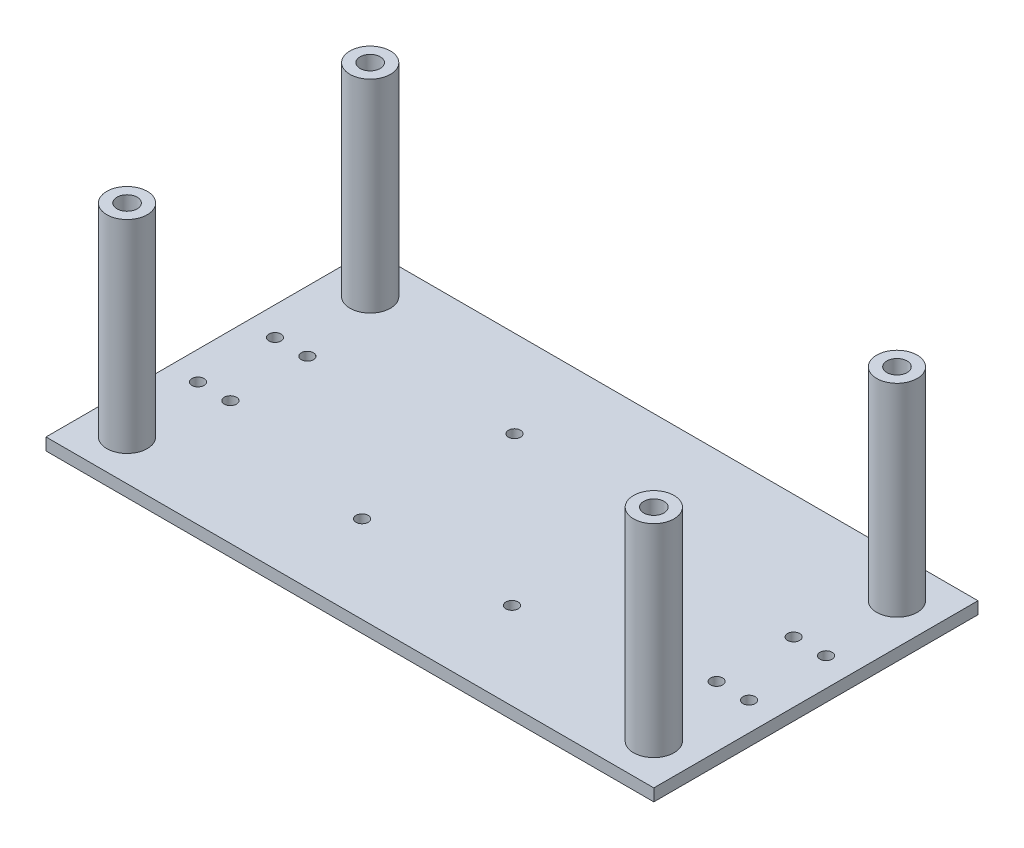
ISO-10303-21;
HEADER;
FILE_DESCRIPTION(('STEP AP214'),'2;1');
FILE_NAME('part.step','',(''),(''),'','','');
FILE_SCHEMA(('AUTOMOTIVE_DESIGN { 1 0 10303 214 1 1 1 1 }'));
ENDSEC;
DATA;
#1=APPLICATION_CONTEXT('core data for automotive mechanical design processes');
#2=APPLICATION_PROTOCOL_DEFINITION('international standard','automotive_design',2000,#1);
#3=PRODUCT_CONTEXT('',#1,'mechanical');
#4=PRODUCT('Part','Part','',(#3));
#5=PRODUCT_RELATED_PRODUCT_CATEGORY('part','',(#4));
#6=PRODUCT_DEFINITION_FORMATION('','',#4);
#7=PRODUCT_DEFINITION_CONTEXT('part definition',#1,'design');
#8=PRODUCT_DEFINITION('design','',#6,#7);
#9=PRODUCT_DEFINITION_SHAPE('','',#8);
#10=(LENGTH_UNIT() NAMED_UNIT(*) SI_UNIT(.MILLI.,.METRE.));
#11=(NAMED_UNIT(*) PLANE_ANGLE_UNIT() SI_UNIT($,.RADIAN.));
#12=(NAMED_UNIT(*) SI_UNIT($,.STERADIAN.) SOLID_ANGLE_UNIT());
#13=UNCERTAINTY_MEASURE_WITH_UNIT(LENGTH_MEASURE(1.E-05),#10,'distance_accuracy_value','');
#14=(GEOMETRIC_REPRESENTATION_CONTEXT(3) GLOBAL_UNCERTAINTY_ASSIGNED_CONTEXT((#13)) GLOBAL_UNIT_ASSIGNED_CONTEXT((#10,
#11,#12)) REPRESENTATION_CONTEXT('',''));
#15=CARTESIAN_POINT('',(0.,0.,0.));
#16=DIRECTION('',(0.,0.,1.));
#17=DIRECTION('',(1.,0.,0.));
#18=AXIS2_PLACEMENT_3D('',#15,#16,#17);
#19=CARTESIAN_POINT('',(66.5352697095436,-3.,0.));
#20=DIRECTION('',(-1.,0.,0.));
#21=DIRECTION('',(0.,0.,1.));
#22=AXIS2_PLACEMENT_3D('',#19,#20,#21);
#23=PLANE('',#22);
#24=DIRECTION('',(0.,0.,1.));
#25=VECTOR('',#24,1.);
#26=CARTESIAN_POINT('',(66.5352697095436,0.,0.));
#27=LINE('',#26,#25);
#28=CARTESIAN_POINT('',(66.5352697095435,0.,-41.8257261410789));
#29=VERTEX_POINT('',#28);
#30=CARTESIAN_POINT('',(66.5352697095436,0.,38.1742738589212));
#31=VERTEX_POINT('',#30);
#32=EDGE_CURVE('E149',#29,#31,#27,.T.);
#33=ORIENTED_EDGE('',*,*,#32,.T.);
#34=DIRECTION('',(0.,1.,0.));
#35=VECTOR('',#34,1.);
#36=CARTESIAN_POINT('',(66.5352697095436,-3.,38.1742738589212));
#37=LINE('',#36,#35);
#38=CARTESIAN_POINT('',(66.5352697095436,-3.,38.1742738589212));
#39=VERTEX_POINT('',#38);
#40=EDGE_CURVE('E86',#39,#31,#37,.T.);
#41=ORIENTED_EDGE('',*,*,#40,.F.);
#42=DIRECTION('',(0.,0.,1.));
#43=VECTOR('',#42,1.);
#44=CARTESIAN_POINT('',(66.5352697095436,-3.,0.));
#45=LINE('',#44,#43);
#46=CARTESIAN_POINT('',(66.5352697095435,-3.,-41.8257261410789));
#47=VERTEX_POINT('',#46);
#48=EDGE_CURVE('E62',#47,#39,#45,.T.);
#49=ORIENTED_EDGE('',*,*,#48,.F.);
#50=DIRECTION('',(0.,1.,0.));
#51=VECTOR('',#50,1.);
#52=CARTESIAN_POINT('',(66.5352697095435,-3.,-41.8257261410789));
#53=LINE('',#52,#51);
#54=EDGE_CURVE('E101',#47,#29,#53,.T.);
#55=ORIENTED_EDGE('',*,*,#54,.T.);
#56=EDGE_LOOP('',(#33,#41,#49,#55));
#57=FACE_BOUND('',#56,.T.);
#58=ADVANCED_FACE('F42',(#57),#23,.F.);
#59=CARTESIAN_POINT('',(0.,-3.,38.1742738589212));
#60=DIRECTION('',(0.,0.,1.));
#61=DIRECTION('',(1.,0.,0.));
#62=AXIS2_PLACEMENT_3D('',#59,#60,#61);
#63=PLANE('',#62);
#64=DIRECTION('',(1.,0.,0.));
#65=VECTOR('',#64,1.);
#66=CARTESIAN_POINT('',(0.,0.,38.1742738589212));
#67=LINE('',#66,#65);
#68=CARTESIAN_POINT('',(-83.4647302904564,0.,38.1742738589212));
#69=VERTEX_POINT('',#68);
#70=EDGE_CURVE('E157',#69,#31,#67,.T.);
#71=ORIENTED_EDGE('',*,*,#70,.F.);
#72=DIRECTION('',(0.,1.,0.));
#73=VECTOR('',#72,1.);
#74=CARTESIAN_POINT('',(-83.4647302904564,-3.,38.1742738589212));
#75=LINE('',#74,#73);
#76=CARTESIAN_POINT('',(-83.4647302904564,-3.,38.1742738589212));
#77=VERTEX_POINT('',#76);
#78=EDGE_CURVE('E79',#77,#69,#75,.T.);
#79=ORIENTED_EDGE('',*,*,#78,.F.);
#80=DIRECTION('',(1.,0.,0.));
#81=VECTOR('',#80,1.);
#82=CARTESIAN_POINT('',(0.,-3.,38.1742738589212));
#83=LINE('',#82,#81);
#84=EDGE_CURVE('E109',#77,#39,#83,.T.);
#85=ORIENTED_EDGE('',*,*,#84,.T.);
#86=ORIENTED_EDGE('',*,*,#40,.T.);
#87=EDGE_LOOP('',(#71,#79,#85,#86));
#88=FACE_BOUND('',#87,.T.);
#89=ADVANCED_FACE('F323',(#88),#63,.T.);
#90=CARTESIAN_POINT('',(-83.4647302904564,-3.,0.));
#91=DIRECTION('',(-1.,0.,0.));
#92=DIRECTION('',(0.,0.,1.));
#93=AXIS2_PLACEMENT_3D('',#90,#91,#92);
#94=PLANE('',#93);
#95=DIRECTION('',(0.,0.,1.));
#96=VECTOR('',#95,1.);
#97=CARTESIAN_POINT('',(-83.4647302904564,0.,0.));
#98=LINE('',#97,#96);
#99=CARTESIAN_POINT('',(-83.4647302904565,0.,-41.8257261410789));
#100=VERTEX_POINT('',#99);
#101=EDGE_CURVE('E97',#100,#69,#98,.T.);
#102=ORIENTED_EDGE('',*,*,#101,.F.);
#103=DIRECTION('',(0.,1.,0.));
#104=VECTOR('',#103,1.);
#105=CARTESIAN_POINT('',(-83.4647302904565,-3.,-41.8257261410789));
#106=LINE('',#105,#104);
#107=CARTESIAN_POINT('',(-83.4647302904565,-3.,-41.8257261410789));
#108=VERTEX_POINT('',#107);
#109=EDGE_CURVE('E94',#108,#100,#106,.T.);
#110=ORIENTED_EDGE('',*,*,#109,.F.);
#111=DIRECTION('',(0.,0.,1.));
#112=VECTOR('',#111,1.);
#113=CARTESIAN_POINT('',(-83.4647302904564,-3.,0.));
#114=LINE('',#113,#112);
#115=EDGE_CURVE('E96',#108,#77,#114,.T.);
#116=ORIENTED_EDGE('',*,*,#115,.T.);
#117=ORIENTED_EDGE('',*,*,#78,.T.);
#118=EDGE_LOOP('',(#102,#110,#116,#117));
#119=FACE_BOUND('',#118,.T.);
#120=ADVANCED_FACE('F95',(#119),#94,.T.);
#121=CARTESIAN_POINT('',(-68.4647302904565,-3.,-11.3257261410788));
#122=DIRECTION('',(0.,1.,0.));
#123=DIRECTION('',(0.,0.,1.));
#124=AXIS2_PLACEMENT_3D('',#121,#122,#123);
#125=CYLINDRICAL_SURFACE('',#124,1.5);
#126=CARTESIAN_POINT('',(-68.4647302904565,-3.,-11.3257261410788));
#127=DIRECTION('',(0.,1.,0.));
#128=DIRECTION('',(0.,0.,1.));
#129=AXIS2_PLACEMENT_3D('',#126,#127,#128);
#130=CIRCLE('',#129,1.5);
#131=CARTESIAN_POINT('',(-68.4647302904565,-3.,-9.82572614107885));
#132=VERTEX_POINT('',#131);
#133=EDGE_CURVE('E128',#132,#132,#130,.T.);
#134=ORIENTED_EDGE('',*,*,#133,.F.);
#135=EDGE_LOOP('',(#134));
#136=FACE_BOUND('',#135,.T.);
#137=CARTESIAN_POINT('',(-68.4647302904565,0.,-11.3257261410788));
#138=DIRECTION('',(0.,1.,0.));
#139=DIRECTION('',(0.,0.,1.));
#140=AXIS2_PLACEMENT_3D('',#137,#138,#139);
#141=CIRCLE('',#140,1.5);
#142=CARTESIAN_POINT('',(-68.4647302904565,0.,-9.82572614107885));
#143=VERTEX_POINT('',#142);
#144=EDGE_CURVE('E173',#143,#143,#141,.T.);
#145=ORIENTED_EDGE('',*,*,#144,.T.);
#146=EDGE_LOOP('',(#145));
#147=FACE_BOUND('',#146,.T.);
#148=ADVANCED_FACE('F675',(#136,#147),#125,.F.);
#149=CARTESIAN_POINT('',(-76.4647302904565,-3.,-11.3257261410788));
#150=DIRECTION('',(0.,1.,0.));
#151=DIRECTION('',(0.,0.,1.));
#152=AXIS2_PLACEMENT_3D('',#149,#150,#151);
#153=CYLINDRICAL_SURFACE('',#152,1.5);
#154=CARTESIAN_POINT('',(-76.4647302904565,-3.,-11.3257261410788));
#155=DIRECTION('',(0.,1.,0.));
#156=DIRECTION('',(0.,0.,1.));
#157=AXIS2_PLACEMENT_3D('',#154,#155,#156);
#158=CIRCLE('',#157,1.5);
#159=CARTESIAN_POINT('',(-76.4647302904565,-3.,-9.82572614107885));
#160=VERTEX_POINT('',#159);
#161=EDGE_CURVE('E124',#160,#160,#158,.T.);
#162=ORIENTED_EDGE('',*,*,#161,.F.);
#163=EDGE_LOOP('',(#162));
#164=FACE_BOUND('',#163,.T.);
#165=CARTESIAN_POINT('',(-76.4647302904565,0.,-11.3257261410788));
#166=DIRECTION('',(0.,1.,0.));
#167=DIRECTION('',(0.,0.,1.));
#168=AXIS2_PLACEMENT_3D('',#165,#166,#167);
#169=CIRCLE('',#168,1.5);
#170=CARTESIAN_POINT('',(-76.4647302904565,0.,-9.82572614107885));
#171=VERTEX_POINT('',#170);
#172=EDGE_CURVE('E169',#171,#171,#169,.T.);
#173=ORIENTED_EDGE('',*,*,#172,.T.);
#174=EDGE_LOOP('',(#173));
#175=FACE_BOUND('',#174,.T.);
#176=ADVANCED_FACE('F666',(#164,#175),#153,.F.);
#177=CARTESIAN_POINT('',(59.5352697095435,-3.,-11.3257261410789));
#178=DIRECTION('',(0.,1.,0.));
#179=DIRECTION('',(0.,0.,1.));
#180=AXIS2_PLACEMENT_3D('',#177,#178,#179);
#181=CYLINDRICAL_SURFACE('',#180,1.5);
#182=CARTESIAN_POINT('',(59.5352697095435,-3.,-11.3257261410789));
#183=DIRECTION('',(0.,1.,0.));
#184=DIRECTION('',(0.,0.,1.));
#185=AXIS2_PLACEMENT_3D('',#182,#183,#184);
#186=CIRCLE('',#185,1.5);
#187=CARTESIAN_POINT('',(59.5352697095435,-3.,-9.82572614107888));
#188=VERTEX_POINT('',#187);
#189=EDGE_CURVE('E120',#188,#188,#186,.F.);
#190=ORIENTED_EDGE('',*,*,#189,.T.);
#191=EDGE_LOOP('',(#190));
#192=FACE_BOUND('',#191,.T.);
#193=CARTESIAN_POINT('',(59.5352697095435,0.,-11.3257261410789));
#194=DIRECTION('',(0.,1.,0.));
#195=DIRECTION('',(0.,0.,1.));
#196=AXIS2_PLACEMENT_3D('',#193,#194,#195);
#197=CIRCLE('',#196,1.5);
#198=CARTESIAN_POINT('',(59.5352697095435,0.,-9.82572614107888));
#199=VERTEX_POINT('',#198);
#200=EDGE_CURVE('E165',#199,#199,#197,.F.);
#201=ORIENTED_EDGE('',*,*,#200,.F.);
#202=EDGE_LOOP('',(#201));
#203=FACE_BOUND('',#202,.T.);
#204=ADVANCED_FACE('F657',(#192,#203),#181,.F.);
#205=CARTESIAN_POINT('',(59.5352697095436,-3.,7.67427385892113));
#206=DIRECTION('',(0.,1.,0.));
#207=DIRECTION('',(0.,0.,1.));
#208=AXIS2_PLACEMENT_3D('',#205,#206,#207);
#209=CYLINDRICAL_SURFACE('',#208,1.5);
#210=CARTESIAN_POINT('',(59.5352697095436,-3.,7.67427385892113));
#211=DIRECTION('',(0.,1.,0.));
#212=DIRECTION('',(0.,0.,1.));
#213=AXIS2_PLACEMENT_3D('',#210,#211,#212);
#214=CIRCLE('',#213,1.5);
#215=CARTESIAN_POINT('',(59.5352697095436,-3.,9.17427385892113));
#216=VERTEX_POINT('',#215);
#217=EDGE_CURVE('E113',#216,#216,#214,.F.);
#218=ORIENTED_EDGE('',*,*,#217,.T.);
#219=EDGE_LOOP('',(#218));
#220=FACE_BOUND('',#219,.T.);
#221=CARTESIAN_POINT('',(59.5352697095436,0.,7.67427385892113));
#222=DIRECTION('',(0.,1.,0.));
#223=DIRECTION('',(0.,0.,1.));
#224=AXIS2_PLACEMENT_3D('',#221,#222,#223);
#225=CIRCLE('',#224,1.5);
#226=CARTESIAN_POINT('',(59.5352697095436,0.,9.17427385892113));
#227=VERTEX_POINT('',#226);
#228=EDGE_CURVE('E161',#227,#227,#225,.F.);
#229=ORIENTED_EDGE('',*,*,#228,.F.);
#230=EDGE_LOOP('',(#229));
#231=FACE_BOUND('',#230,.T.);
#232=ADVANCED_FACE('F650',(#220,#231),#209,.F.);
#233=CARTESIAN_POINT('',(0.,-3.,-41.8257261410789));
#234=DIRECTION('',(0.,0.,1.));
#235=DIRECTION('',(1.,0.,0.));
#236=AXIS2_PLACEMENT_3D('',#233,#234,#235);
#237=PLANE('',#236);
#238=DIRECTION('',(1.,0.,0.));
#239=VECTOR('',#238,1.);
#240=CARTESIAN_POINT('',(0.,0.,-41.8257261410789));
#241=LINE('',#240,#239);
#242=EDGE_CURVE('E152',#100,#29,#241,.T.);
#243=ORIENTED_EDGE('',*,*,#242,.T.);
#244=ORIENTED_EDGE('',*,*,#54,.F.);
#245=DIRECTION('',(1.,0.,0.));
#246=VECTOR('',#245,1.);
#247=CARTESIAN_POINT('',(0.,-3.,-41.8257261410789));
#248=LINE('',#247,#246);
#249=EDGE_CURVE('E91',#108,#47,#248,.T.);
#250=ORIENTED_EDGE('',*,*,#249,.F.);
#251=ORIENTED_EDGE('',*,*,#109,.T.);
#252=EDGE_LOOP('',(#243,#244,#250,#251));
#253=FACE_BOUND('',#252,.T.);
#254=ADVANCED_FACE('F103',(#253),#237,.F.);
#255=CARTESIAN_POINT('',(-68.4647302904565,-3.,7.67427385892115));
#256=DIRECTION('',(0.,1.,0.));
#257=DIRECTION('',(0.,0.,1.));
#258=AXIS2_PLACEMENT_3D('',#255,#256,#257);
#259=CYLINDRICAL_SURFACE('',#258,1.5);
#260=CARTESIAN_POINT('',(-68.4647302904565,-3.,7.67427385892115));
#261=DIRECTION('',(0.,1.,0.));
#262=DIRECTION('',(0.,0.,1.));
#263=AXIS2_PLACEMENT_3D('',#260,#261,#262);
#264=CIRCLE('',#263,1.5);
#265=CARTESIAN_POINT('',(-68.4647302904565,-3.,9.17427385892115));
#266=VERTEX_POINT('',#265);
#267=EDGE_CURVE('E275',#266,#266,#264,.T.);
#268=ORIENTED_EDGE('',*,*,#267,.F.);
#269=EDGE_LOOP('',(#268));
#270=FACE_BOUND('',#269,.T.);
#271=CARTESIAN_POINT('',(-68.4647302904565,0.,7.67427385892115));
#272=DIRECTION('',(0.,1.,0.));
#273=DIRECTION('',(0.,0.,1.));
#274=AXIS2_PLACEMENT_3D('',#271,#272,#273);
#275=CIRCLE('',#274,1.5);
#276=CARTESIAN_POINT('',(-68.4647302904565,0.,9.17427385892115));
#277=VERTEX_POINT('',#276);
#278=EDGE_CURVE('E145',#277,#277,#275,.T.);
#279=ORIENTED_EDGE('',*,*,#278,.T.);
#280=EDGE_LOOP('',(#279));
#281=FACE_BOUND('',#280,.T.);
#282=ADVANCED_FACE('F282',(#270,#281),#259,.F.);
#283=CARTESIAN_POINT('',(-76.4647302904564,-3.,7.67427385892115));
#284=DIRECTION('',(0.,1.,0.));
#285=DIRECTION('',(0.,0.,1.));
#286=AXIS2_PLACEMENT_3D('',#283,#284,#285);
#287=CYLINDRICAL_SURFACE('',#286,1.5);
#288=CARTESIAN_POINT('',(-76.4647302904564,-3.,7.67427385892115));
#289=DIRECTION('',(0.,1.,0.));
#290=DIRECTION('',(0.,0.,1.));
#291=AXIS2_PLACEMENT_3D('',#288,#289,#290);
#292=CIRCLE('',#291,1.5);
#293=CARTESIAN_POINT('',(-76.4647302904564,-3.,9.17427385892115));
#294=VERTEX_POINT('',#293);
#295=EDGE_CURVE('E271',#294,#294,#292,.T.);
#296=ORIENTED_EDGE('',*,*,#295,.F.);
#297=EDGE_LOOP('',(#296));
#298=FACE_BOUND('',#297,.T.);
#299=CARTESIAN_POINT('',(-76.4647302904564,0.,7.67427385892115));
#300=DIRECTION('',(0.,1.,0.));
#301=DIRECTION('',(0.,0.,1.));
#302=AXIS2_PLACEMENT_3D('',#299,#300,#301);
#303=CIRCLE('',#302,1.5);
#304=CARTESIAN_POINT('',(-76.4647302904564,0.,9.17427385892115));
#305=VERTEX_POINT('',#304);
#306=EDGE_CURVE('E140',#305,#305,#303,.T.);
#307=ORIENTED_EDGE('',*,*,#306,.T.);
#308=EDGE_LOOP('',(#307));
#309=FACE_BOUND('',#308,.T.);
#310=ADVANCED_FACE('F285',(#298,#309),#287,.F.);
#311=CARTESIAN_POINT('',(51.5352697095436,-3.,7.67427385892113));
#312=DIRECTION('',(0.,1.,0.));
#313=DIRECTION('',(0.,0.,1.));
#314=AXIS2_PLACEMENT_3D('',#311,#312,#313);
#315=CYLINDRICAL_SURFACE('',#314,1.5);
#316=CARTESIAN_POINT('',(51.5352697095436,-3.,7.67427385892113));
#317=DIRECTION('',(0.,1.,0.));
#318=DIRECTION('',(0.,0.,1.));
#319=AXIS2_PLACEMENT_3D('',#316,#317,#318);
#320=CIRCLE('',#319,1.5);
#321=CARTESIAN_POINT('',(51.5352697095436,-3.,9.17427385892113));
#322=VERTEX_POINT('',#321);
#323=EDGE_CURVE('E181',#322,#322,#320,.F.);
#324=ORIENTED_EDGE('',*,*,#323,.T.);
#325=EDGE_LOOP('',(#324));
#326=FACE_BOUND('',#325,.T.);
#327=CARTESIAN_POINT('',(51.5352697095436,0.,7.67427385892113));
#328=DIRECTION('',(0.,1.,0.));
#329=DIRECTION('',(0.,0.,1.));
#330=AXIS2_PLACEMENT_3D('',#327,#328,#329);
#331=CIRCLE('',#330,1.5);
#332=CARTESIAN_POINT('',(51.5352697095436,0.,9.17427385892113));
#333=VERTEX_POINT('',#332);
#334=EDGE_CURVE('E136',#333,#333,#331,.F.);
#335=ORIENTED_EDGE('',*,*,#334,.F.);
#336=EDGE_LOOP('',(#335));
#337=FACE_BOUND('',#336,.T.);
#338=ADVANCED_FACE('F44',(#326,#337),#315,.F.);
#339=CARTESIAN_POINT('',(51.5352697095436,-3.,-11.3257261410789));
#340=DIRECTION('',(0.,1.,0.));
#341=DIRECTION('',(0.,0.,1.));
#342=AXIS2_PLACEMENT_3D('',#339,#340,#341);
#343=CYLINDRICAL_SURFACE('',#342,1.49999999999999);
#344=CARTESIAN_POINT('',(51.5352697095436,-3.,-11.3257261410789));
#345=DIRECTION('',(0.,1.,0.));
#346=DIRECTION('',(0.,0.,1.));
#347=AXIS2_PLACEMENT_3D('',#344,#345,#346);
#348=CIRCLE('',#347,1.49999999999999);
#349=CARTESIAN_POINT('',(51.5352697095436,-3.,-9.82572614107888));
#350=VERTEX_POINT('',#349);
#351=EDGE_CURVE('E132',#350,#350,#348,.F.);
#352=ORIENTED_EDGE('',*,*,#351,.T.);
#353=EDGE_LOOP('',(#352));
#354=FACE_BOUND('',#353,.T.);
#355=CARTESIAN_POINT('',(51.5352697095436,0.,-11.3257261410789));
#356=DIRECTION('',(0.,1.,0.));
#357=DIRECTION('',(0.,0.,1.));
#358=AXIS2_PLACEMENT_3D('',#355,#356,#357);
#359=CIRCLE('',#358,1.49999999999999);
#360=CARTESIAN_POINT('',(51.5352697095436,0.,-9.82572614107888));
#361=VERTEX_POINT('',#360);
#362=EDGE_CURVE('E177',#361,#361,#359,.F.);
#363=ORIENTED_EDGE('',*,*,#362,.F.);
#364=EDGE_LOOP('',(#363));
#365=FACE_BOUND('',#364,.T.);
#366=ADVANCED_FACE('F309',(#354,#365),#343,.F.);
#367=CARTESIAN_POINT('',(0.,-3.,0.));
#368=DIRECTION('',(0.,1.,0.));
#369=DIRECTION('',(0.,0.,1.));
#370=AXIS2_PLACEMENT_3D('',#367,#368,#369);
#371=PLANE('',#370);
#372=CARTESIAN_POINT('',(-26.353154242644,-3.,-20.3257261410788));
#373=DIRECTION('',(0.,-1.,0.));
#374=DIRECTION('',(0.,0.,-1.));
#375=AXIS2_PLACEMENT_3D('',#372,#373,#374);
#376=CIRCLE('',#375,1.5);
#377=CARTESIAN_POINT('',(-26.353154242644,-3.,-21.8257261410788));
#378=VERTEX_POINT('',#377);
#379=EDGE_CURVE('E561',#378,#378,#376,.T.);
#380=ORIENTED_EDGE('',*,*,#379,.F.);
#381=EDGE_LOOP('',(#380));
#382=FACE_BOUND('',#381,.T.);
#383=CARTESIAN_POINT('',(10.0352697095436,-3.,-20.3257261410788));
#384=DIRECTION('',(0.,-1.,0.));
#385=DIRECTION('',(0.,0.,-1.));
#386=AXIS2_PLACEMENT_3D('',#383,#384,#385);
#387=CIRCLE('',#386,1.5);
#388=CARTESIAN_POINT('',(10.0352697095436,-3.,-21.8257261410788));
#389=VERTEX_POINT('',#388);
#390=EDGE_CURVE('E563',#389,#389,#387,.T.);
#391=ORIENTED_EDGE('',*,*,#390,.F.);
#392=EDGE_LOOP('',(#391));
#393=FACE_BOUND('',#392,.T.);
#394=CARTESIAN_POINT('',(10.0352697095435,-3.,16.6742738589212));
#395=DIRECTION('',(0.,-1.,0.));
#396=DIRECTION('',(0.,0.,-1.));
#397=AXIS2_PLACEMENT_3D('',#394,#395,#396);
#398=CIRCLE('',#397,1.5);
#399=CARTESIAN_POINT('',(10.0352697095435,-3.,15.1742738589212));
#400=VERTEX_POINT('',#399);
#401=EDGE_CURVE('E566',#400,#400,#398,.T.);
#402=ORIENTED_EDGE('',*,*,#401,.F.);
#403=EDGE_LOOP('',(#402));
#404=FACE_BOUND('',#403,.T.);
#405=CARTESIAN_POINT('',(-26.9647302904565,-3.,16.6742738589212));
#406=DIRECTION('',(0.,-1.,0.));
#407=DIRECTION('',(0.,0.,-1.));
#408=AXIS2_PLACEMENT_3D('',#405,#406,#407);
#409=CIRCLE('',#408,1.5);
#410=CARTESIAN_POINT('',(-26.9647302904565,-3.,15.1742738589212));
#411=VERTEX_POINT('',#410);
#412=EDGE_CURVE('E204',#411,#411,#409,.T.);
#413=ORIENTED_EDGE('',*,*,#412,.F.);
#414=EDGE_LOOP('',(#413));
#415=FACE_BOUND('',#414,.T.);
#416=ORIENTED_EDGE('',*,*,#323,.F.);
#417=EDGE_LOOP('',(#416));
#418=FACE_BOUND('',#417,.T.);
#419=ORIENTED_EDGE('',*,*,#295,.T.);
#420=EDGE_LOOP('',(#419));
#421=FACE_BOUND('',#420,.T.);
#422=ORIENTED_EDGE('',*,*,#267,.T.);
#423=EDGE_LOOP('',(#422));
#424=FACE_BOUND('',#423,.T.);
#425=ORIENTED_EDGE('',*,*,#48,.T.);
#426=ORIENTED_EDGE('',*,*,#84,.F.);
#427=ORIENTED_EDGE('',*,*,#115,.F.);
#428=ORIENTED_EDGE('',*,*,#249,.T.);
#429=EDGE_LOOP('',(#425,#426,#427,#428));
#430=FACE_BOUND('',#429,.T.);
#431=ORIENTED_EDGE('',*,*,#217,.F.);
#432=EDGE_LOOP('',(#431));
#433=FACE_BOUND('',#432,.T.);
#434=ORIENTED_EDGE('',*,*,#189,.F.);
#435=EDGE_LOOP('',(#434));
#436=FACE_BOUND('',#435,.T.);
#437=ORIENTED_EDGE('',*,*,#161,.T.);
#438=EDGE_LOOP('',(#437));
#439=FACE_BOUND('',#438,.T.);
#440=ORIENTED_EDGE('',*,*,#133,.T.);
#441=EDGE_LOOP('',(#440));
#442=FACE_BOUND('',#441,.T.);
#443=ORIENTED_EDGE('',*,*,#351,.F.);
#444=EDGE_LOOP('',(#443));
#445=FACE_BOUND('',#444,.T.);
#446=ADVANCED_FACE('F107',(#382,#393,#404,#415,#418,#421,#424,#430,#433,#436,#439,#442,#445),
#371,.F.);
#447=CARTESIAN_POINT('',(0.,0.,0.));
#448=DIRECTION('',(0.,1.,0.));
#449=DIRECTION('',(0.,0.,1.));
#450=AXIS2_PLACEMENT_3D('',#447,#448,#449);
#451=PLANE('',#450);
#452=CARTESIAN_POINT('',(-26.353154242644,0.,-20.3257261410788));
#453=DIRECTION('',(0.,1.,0.));
#454=DIRECTION('',(0.,0.,1.));
#455=AXIS2_PLACEMENT_3D('',#452,#453,#454);
#456=CIRCLE('',#455,1.5);
#457=CARTESIAN_POINT('',(-26.353154242644,0.,-18.8257261410788));
#458=VERTEX_POINT('',#457);
#459=EDGE_CURVE('E46',#458,#458,#456,.T.);
#460=ORIENTED_EDGE('',*,*,#459,.F.);
#461=EDGE_LOOP('',(#460));
#462=FACE_BOUND('',#461,.T.);
#463=CARTESIAN_POINT('',(10.0352697095436,0.,-20.3257261410788));
#464=DIRECTION('',(0.,1.,0.));
#465=DIRECTION('',(0.,0.,1.));
#466=AXIS2_PLACEMENT_3D('',#463,#464,#465);
#467=CIRCLE('',#466,1.5);
#468=CARTESIAN_POINT('',(10.0352697095436,0.,-18.8257261410788));
#469=VERTEX_POINT('',#468);
#470=EDGE_CURVE('E207',#469,#469,#467,.T.);
#471=ORIENTED_EDGE('',*,*,#470,.F.);
#472=EDGE_LOOP('',(#471));
#473=FACE_BOUND('',#472,.T.);
#474=CARTESIAN_POINT('',(10.0352697095435,0.,16.6742738589212));
#475=DIRECTION('',(0.,1.,0.));
#476=DIRECTION('',(0.,0.,1.));
#477=AXIS2_PLACEMENT_3D('',#474,#475,#476);
#478=CIRCLE('',#477,1.5);
#479=CARTESIAN_POINT('',(10.0352697095435,0.,18.1742738589212));
#480=VERTEX_POINT('',#479);
#481=EDGE_CURVE('E203',#480,#480,#478,.T.);
#482=ORIENTED_EDGE('',*,*,#481,.F.);
#483=EDGE_LOOP('',(#482));
#484=FACE_BOUND('',#483,.T.);
#485=CARTESIAN_POINT('',(-26.9647302904565,0.,16.6742738589212));
#486=DIRECTION('',(0.,1.,0.));
#487=DIRECTION('',(0.,0.,1.));
#488=AXIS2_PLACEMENT_3D('',#485,#486,#487);
#489=CIRCLE('',#488,1.5);
#490=CARTESIAN_POINT('',(-26.9647302904565,0.,18.1742738589212));
#491=VERTEX_POINT('',#490);
#492=EDGE_CURVE('E199',#491,#491,#489,.T.);
#493=ORIENTED_EDGE('',*,*,#492,.F.);
#494=EDGE_LOOP('',(#493));
#495=FACE_BOUND('',#494,.T.);
#496=CARTESIAN_POINT('',(-73.4647302904565,0.,28.1742738589212));
#497=DIRECTION('',(0.,1.,0.));
#498=DIRECTION('',(0.,0.,1.));
#499=AXIS2_PLACEMENT_3D('',#496,#497,#498);
#500=CIRCLE('',#499,5.);
#501=CARTESIAN_POINT('',(-73.4647302904565,0.,33.1742738589212));
#502=VERTEX_POINT('',#501);
#503=EDGE_CURVE('E219',#502,#502,#500,.T.);
#504=ORIENTED_EDGE('',*,*,#503,.F.);
#505=EDGE_LOOP('',(#504));
#506=FACE_BOUND('',#505,.T.);
#507=CARTESIAN_POINT('',(56.5352697095435,0.,28.1742738589212));
#508=DIRECTION('',(0.,1.,0.));
#509=DIRECTION('',(0.,0.,1.));
#510=AXIS2_PLACEMENT_3D('',#507,#508,#509);
#511=CIRCLE('',#510,5.);
#512=CARTESIAN_POINT('',(56.5352697095435,0.,33.1742738589212));
#513=VERTEX_POINT('',#512);
#514=EDGE_CURVE('E237',#513,#513,#511,.T.);
#515=ORIENTED_EDGE('',*,*,#514,.F.);
#516=EDGE_LOOP('',(#515));
#517=FACE_BOUND('',#516,.T.);
#518=CARTESIAN_POINT('',(56.5352697095435,0.,-31.8257261410788));
#519=DIRECTION('',(0.,1.,0.));
#520=DIRECTION('',(0.,0.,1.));
#521=AXIS2_PLACEMENT_3D('',#518,#519,#520);
#522=CIRCLE('',#521,5.);
#523=CARTESIAN_POINT('',(56.5352697095435,0.,-26.8257261410788));
#524=VERTEX_POINT('',#523);
#525=EDGE_CURVE('E249',#524,#524,#522,.T.);
#526=ORIENTED_EDGE('',*,*,#525,.F.);
#527=EDGE_LOOP('',(#526));
#528=FACE_BOUND('',#527,.T.);
#529=CARTESIAN_POINT('',(-73.4647302904565,0.,-31.8257261410788));
#530=DIRECTION('',(0.,1.,0.));
#531=DIRECTION('',(0.,0.,1.));
#532=AXIS2_PLACEMENT_3D('',#529,#530,#531);
#533=CIRCLE('',#532,5.00000000000001);
#534=CARTESIAN_POINT('',(-73.4647302904565,0.,-26.8257261410788));
#535=VERTEX_POINT('',#534);
#536=EDGE_CURVE('E261',#535,#535,#533,.T.);
#537=ORIENTED_EDGE('',*,*,#536,.F.);
#538=EDGE_LOOP('',(#537));
#539=FACE_BOUND('',#538,.T.);
#540=ORIENTED_EDGE('',*,*,#334,.T.);
#541=EDGE_LOOP('',(#540));
#542=FACE_BOUND('',#541,.T.);
#543=ORIENTED_EDGE('',*,*,#306,.F.);
#544=EDGE_LOOP('',(#543));
#545=FACE_BOUND('',#544,.T.);
#546=ORIENTED_EDGE('',*,*,#278,.F.);
#547=EDGE_LOOP('',(#546));
#548=FACE_BOUND('',#547,.T.);
#549=ORIENTED_EDGE('',*,*,#32,.F.);
#550=ORIENTED_EDGE('',*,*,#242,.F.);
#551=ORIENTED_EDGE('',*,*,#101,.T.);
#552=ORIENTED_EDGE('',*,*,#70,.T.);
#553=EDGE_LOOP('',(#549,#550,#551,#552));
#554=FACE_BOUND('',#553,.T.);
#555=ORIENTED_EDGE('',*,*,#228,.T.);
#556=EDGE_LOOP('',(#555));
#557=FACE_BOUND('',#556,.T.);
#558=ORIENTED_EDGE('',*,*,#200,.T.);
#559=EDGE_LOOP('',(#558));
#560=FACE_BOUND('',#559,.T.);
#561=ORIENTED_EDGE('',*,*,#172,.F.);
#562=EDGE_LOOP('',(#561));
#563=FACE_BOUND('',#562,.T.);
#564=ORIENTED_EDGE('',*,*,#144,.F.);
#565=EDGE_LOOP('',(#564));
#566=FACE_BOUND('',#565,.T.);
#567=ORIENTED_EDGE('',*,*,#362,.T.);
#568=EDGE_LOOP('',(#567));
#569=FACE_BOUND('',#568,.T.);
#570=ADVANCED_FACE('F289',(#462,#473,#484,#495,#506,#517,#528,#539,#542,#545,#548,#554,#557,
#560,#563,#566,#569),#451,.T.);
#571=CARTESIAN_POINT('',(-73.4647302904565,50.,-31.8257261410788));
#572=DIRECTION('',(0.,1.,0.));
#573=DIRECTION('',(0.,0.,1.));
#574=AXIS2_PLACEMENT_3D('',#571,#572,#573);
#575=PLANE('',#574);
#576=CARTESIAN_POINT('',(-73.4647302904565,50.,-31.8257261410788));
#577=DIRECTION('',(0.,1.,0.));
#578=DIRECTION('',(0.,0.,1.));
#579=AXIS2_PLACEMENT_3D('',#576,#577,#578);
#580=CIRCLE('',#579,5.00000000000001);
#581=CARTESIAN_POINT('',(-73.4647302904565,50.,-26.8257261410788));
#582=VERTEX_POINT('',#581);
#583=EDGE_CURVE('E141',#582,#582,#580,.T.);
#584=ORIENTED_EDGE('',*,*,#583,.T.);
#585=EDGE_LOOP('',(#584));
#586=FACE_BOUND('',#585,.T.);
#587=CARTESIAN_POINT('',(-73.4647302904565,50.,-31.8257261410788));
#588=DIRECTION('',(0.,1.,0.));
#589=DIRECTION('',(0.,0.,1.));
#590=AXIS2_PLACEMENT_3D('',#587,#588,#589);
#591=CIRCLE('',#590,2.50000000000001);
#592=CARTESIAN_POINT('',(-73.4647302904565,50.,-29.3257261410788));
#593=VERTEX_POINT('',#592);
#594=EDGE_CURVE('E254',#593,#593,#591,.T.);
#595=ORIENTED_EDGE('',*,*,#594,.F.);
#596=EDGE_LOOP('',(#595));
#597=FACE_BOUND('',#596,.T.);
#598=ADVANCED_FACE('F292',(#586,#597),#575,.T.);
#599=CARTESIAN_POINT('',(-73.4647302904565,50.,-31.8257261410788));
#600=DIRECTION('',(0.,-1.,0.));
#601=DIRECTION('',(0.,0.,-1.));
#602=AXIS2_PLACEMENT_3D('',#599,#600,#601);
#603=CYLINDRICAL_SURFACE('',#602,5.00000000000001);
#604=ORIENTED_EDGE('',*,*,#583,.F.);
#605=EDGE_LOOP('',(#604));
#606=FACE_BOUND('',#605,.T.);
#607=ORIENTED_EDGE('',*,*,#536,.T.);
#608=EDGE_LOOP('',(#607));
#609=FACE_BOUND('',#608,.T.);
#610=ADVANCED_FACE('F362',(#606,#609),#603,.T.);
#611=CARTESIAN_POINT('',(-73.4647302904565,50.,-31.8257261410788));
#612=DIRECTION('',(0.,-1.,0.));
#613=DIRECTION('',(0.,0.,-1.));
#614=AXIS2_PLACEMENT_3D('',#611,#612,#613);
#615=CYLINDRICAL_SURFACE('',#614,2.50000000000001);
#616=ORIENTED_EDGE('',*,*,#594,.T.);
#617=EDGE_LOOP('',(#616));
#618=FACE_BOUND('',#617,.T.);
#619=CARTESIAN_POINT('',(-73.4647302904565,0.,-31.8257261410788));
#620=DIRECTION('',(0.,1.,0.));
#621=DIRECTION('',(0.,0.,1.));
#622=AXIS2_PLACEMENT_3D('',#619,#620,#621);
#623=CIRCLE('',#622,2.50000000000001);
#624=CARTESIAN_POINT('',(-73.4647302904565,0.,-29.3257261410788));
#625=VERTEX_POINT('',#624);
#626=EDGE_CURVE('E184',#625,#625,#623,.F.);
#627=ORIENTED_EDGE('',*,*,#626,.T.);
#628=EDGE_LOOP('',(#627));
#629=FACE_BOUND('',#628,.T.);
#630=ADVANCED_FACE('F374',(#618,#629),#615,.F.);
#631=ORIENTED_EDGE('',*,*,#626,.F.);
#632=EDGE_LOOP('',(#631));
#633=FACE_BOUND('',#632,.T.);
#634=ADVANCED_FACE('F296',(#633),#451,.T.);
#635=CARTESIAN_POINT('',(56.5352697095435,50.,-31.8257261410788));
#636=DIRECTION('',(0.,1.,0.));
#637=DIRECTION('',(0.,0.,1.));
#638=AXIS2_PLACEMENT_3D('',#635,#636,#637);
#639=PLANE('',#638);
#640=CARTESIAN_POINT('',(56.5352697095435,50.,-31.8257261410788));
#641=DIRECTION('',(0.,1.,0.));
#642=DIRECTION('',(0.,0.,1.));
#643=AXIS2_PLACEMENT_3D('',#640,#641,#642);
#644=CIRCLE('',#643,5.);
#645=CARTESIAN_POINT('',(56.5352697095435,50.,-26.8257261410788));
#646=VERTEX_POINT('',#645);
#647=EDGE_CURVE('E250',#646,#646,#644,.T.);
#648=ORIENTED_EDGE('',*,*,#647,.T.);
#649=EDGE_LOOP('',(#648));
#650=FACE_BOUND('',#649,.T.);
#651=CARTESIAN_POINT('',(56.5352697095435,50.,-31.8257261410788));
#652=DIRECTION('',(0.,1.,0.));
#653=DIRECTION('',(0.,0.,1.));
#654=AXIS2_PLACEMENT_3D('',#651,#652,#653);
#655=CIRCLE('',#654,2.5);
#656=CARTESIAN_POINT('',(56.5352697095435,50.,-29.3257261410788));
#657=VERTEX_POINT('',#656);
#658=EDGE_CURVE('E242',#657,#657,#655,.T.);
#659=ORIENTED_EDGE('',*,*,#658,.F.);
#660=EDGE_LOOP('',(#659));
#661=FACE_BOUND('',#660,.T.);
#662=ADVANCED_FACE('F394',(#650,#661),#639,.T.);
#663=CARTESIAN_POINT('',(56.5352697095435,50.,-31.8257261410788));
#664=DIRECTION('',(0.,-1.,0.));
#665=DIRECTION('',(0.,0.,-1.));
#666=AXIS2_PLACEMENT_3D('',#663,#664,#665);
#667=CYLINDRICAL_SURFACE('',#666,5.);
#668=ORIENTED_EDGE('',*,*,#647,.F.);
#669=EDGE_LOOP('',(#668));
#670=FACE_BOUND('',#669,.T.);
#671=ORIENTED_EDGE('',*,*,#525,.T.);
#672=EDGE_LOOP('',(#671));
#673=FACE_BOUND('',#672,.T.);
#674=ADVANCED_FACE('F405',(#670,#673),#667,.T.);
#675=CARTESIAN_POINT('',(56.5352697095435,50.,-31.8257261410788));
#676=DIRECTION('',(0.,-1.,0.));
#677=DIRECTION('',(0.,0.,-1.));
#678=AXIS2_PLACEMENT_3D('',#675,#676,#677);
#679=CYLINDRICAL_SURFACE('',#678,2.5);
#680=ORIENTED_EDGE('',*,*,#658,.T.);
#681=EDGE_LOOP('',(#680));
#682=FACE_BOUND('',#681,.T.);
#683=CARTESIAN_POINT('',(56.5352697095435,0.,-31.8257261410788));
#684=DIRECTION('',(0.,1.,0.));
#685=DIRECTION('',(0.,0.,1.));
#686=AXIS2_PLACEMENT_3D('',#683,#684,#685);
#687=CIRCLE('',#686,2.5);
#688=CARTESIAN_POINT('',(56.5352697095435,0.,-29.3257261410788));
#689=VERTEX_POINT('',#688);
#690=EDGE_CURVE('E192',#689,#689,#687,.F.);
#691=ORIENTED_EDGE('',*,*,#690,.T.);
#692=EDGE_LOOP('',(#691));
#693=FACE_BOUND('',#692,.T.);
#694=ADVANCED_FACE('F415',(#682,#693),#679,.F.);
#695=ORIENTED_EDGE('',*,*,#690,.F.);
#696=EDGE_LOOP('',(#695));
#697=FACE_BOUND('',#696,.T.);
#698=ADVANCED_FACE('F396',(#697),#451,.T.);
#699=CARTESIAN_POINT('',(56.5352697095435,50.,28.1742738589212));
#700=DIRECTION('',(0.,1.,0.));
#701=DIRECTION('',(0.,0.,1.));
#702=AXIS2_PLACEMENT_3D('',#699,#700,#701);
#703=PLANE('',#702);
#704=CARTESIAN_POINT('',(56.5352697095435,50.,28.1742738589212));
#705=DIRECTION('',(0.,1.,0.));
#706=DIRECTION('',(0.,0.,1.));
#707=AXIS2_PLACEMENT_3D('',#704,#705,#706);
#708=CIRCLE('',#707,5.);
#709=CARTESIAN_POINT('',(56.5352697095435,50.,33.1742738589212));
#710=VERTEX_POINT('',#709);
#711=EDGE_CURVE('E238',#710,#710,#708,.T.);
#712=ORIENTED_EDGE('',*,*,#711,.T.);
#713=EDGE_LOOP('',(#712));
#714=FACE_BOUND('',#713,.T.);
#715=CARTESIAN_POINT('',(56.5352697095435,50.,28.1742738589212));
#716=DIRECTION('',(0.,1.,0.));
#717=DIRECTION('',(0.,0.,1.));
#718=AXIS2_PLACEMENT_3D('',#715,#716,#717);
#719=CIRCLE('',#718,2.5);
#720=CARTESIAN_POINT('',(56.5352697095435,50.,30.6742738589212));
#721=VERTEX_POINT('',#720);
#722=EDGE_CURVE('E232',#721,#721,#719,.T.);
#723=ORIENTED_EDGE('',*,*,#722,.F.);
#724=EDGE_LOOP('',(#723));
#725=FACE_BOUND('',#724,.T.);
#726=ADVANCED_FACE('F435',(#714,#725),#703,.T.);
#727=CARTESIAN_POINT('',(56.5352697095435,50.,28.1742738589212));
#728=DIRECTION('',(0.,-1.,0.));
#729=DIRECTION('',(0.,0.,-1.));
#730=AXIS2_PLACEMENT_3D('',#727,#728,#729);
#731=CYLINDRICAL_SURFACE('',#730,5.);
#732=ORIENTED_EDGE('',*,*,#711,.F.);
#733=EDGE_LOOP('',(#732));
#734=FACE_BOUND('',#733,.T.);
#735=ORIENTED_EDGE('',*,*,#514,.T.);
#736=EDGE_LOOP('',(#735));
#737=FACE_BOUND('',#736,.T.);
#738=ADVANCED_FACE('F445',(#734,#737),#731,.T.);
#739=CARTESIAN_POINT('',(56.5352697095435,50.,28.1742738589212));
#740=DIRECTION('',(0.,-1.,0.));
#741=DIRECTION('',(0.,0.,-1.));
#742=AXIS2_PLACEMENT_3D('',#739,#740,#741);
#743=CYLINDRICAL_SURFACE('',#742,2.5);
#744=ORIENTED_EDGE('',*,*,#722,.T.);
#745=EDGE_LOOP('',(#744));
#746=FACE_BOUND('',#745,.T.);
#747=CARTESIAN_POINT('',(56.5352697095435,0.,28.1742738589212));
#748=DIRECTION('',(0.,1.,0.));
#749=DIRECTION('',(0.,0.,1.));
#750=AXIS2_PLACEMENT_3D('',#747,#748,#749);
#751=CIRCLE('',#750,2.5);
#752=CARTESIAN_POINT('',(56.5352697095435,0.,30.6742738589212));
#753=VERTEX_POINT('',#752);
#754=EDGE_CURVE('E53',#753,#753,#751,.F.);
#755=ORIENTED_EDGE('',*,*,#754,.T.);
#756=EDGE_LOOP('',(#755));
#757=FACE_BOUND('',#756,.T.);
#758=ADVANCED_FACE('F455',(#746,#757),#743,.F.);
#759=ORIENTED_EDGE('',*,*,#754,.F.);
#760=EDGE_LOOP('',(#759));
#761=FACE_BOUND('',#760,.T.);
#762=ADVANCED_FACE('F437',(#761),#451,.T.);
#763=CARTESIAN_POINT('',(-73.4647302904565,50.,28.1742738589212));
#764=DIRECTION('',(0.,1.,0.));
#765=DIRECTION('',(0.,0.,1.));
#766=AXIS2_PLACEMENT_3D('',#763,#764,#765);
#767=PLANE('',#766);
#768=CARTESIAN_POINT('',(-73.4647302904565,50.,28.1742738589212));
#769=DIRECTION('',(0.,1.,0.));
#770=DIRECTION('',(0.,0.,1.));
#771=AXIS2_PLACEMENT_3D('',#768,#769,#770);
#772=CIRCLE('',#771,5.);
#773=CARTESIAN_POINT('',(-73.4647302904565,50.,33.1742738589212));
#774=VERTEX_POINT('',#773);
#775=EDGE_CURVE('E225',#774,#774,#772,.T.);
#776=ORIENTED_EDGE('',*,*,#775,.T.);
#777=EDGE_LOOP('',(#776));
#778=FACE_BOUND('',#777,.T.);
#779=CARTESIAN_POINT('',(-73.4647302904565,50.,28.1742738589212));
#780=DIRECTION('',(0.,1.,0.));
#781=DIRECTION('',(0.,0.,1.));
#782=AXIS2_PLACEMENT_3D('',#779,#780,#781);
#783=CIRCLE('',#782,2.50000000000001);
#784=CARTESIAN_POINT('',(-73.4647302904565,50.,30.6742738589212));
#785=VERTEX_POINT('',#784);
#786=EDGE_CURVE('E214',#785,#785,#783,.T.);
#787=ORIENTED_EDGE('',*,*,#786,.F.);
#788=EDGE_LOOP('',(#787));
#789=FACE_BOUND('',#788,.T.);
#790=ADVANCED_FACE('F475',(#778,#789),#767,.T.);
#791=CARTESIAN_POINT('',(-73.4647302904565,50.,28.1742738589212));
#792=DIRECTION('',(0.,-1.,0.));
#793=DIRECTION('',(0.,0.,-1.));
#794=AXIS2_PLACEMENT_3D('',#791,#792,#793);
#795=CYLINDRICAL_SURFACE('',#794,5.);
#796=ORIENTED_EDGE('',*,*,#775,.F.);
#797=EDGE_LOOP('',(#796));
#798=FACE_BOUND('',#797,.T.);
#799=ORIENTED_EDGE('',*,*,#503,.T.);
#800=EDGE_LOOP('',(#799));
#801=FACE_BOUND('',#800,.T.);
#802=ADVANCED_FACE('F484',(#798,#801),#795,.T.);
#803=CARTESIAN_POINT('',(-73.4647302904565,50.,28.1742738589212));
#804=DIRECTION('',(0.,-1.,0.));
#805=DIRECTION('',(0.,0.,-1.));
#806=AXIS2_PLACEMENT_3D('',#803,#804,#805);
#807=CYLINDRICAL_SURFACE('',#806,2.50000000000001);
#808=ORIENTED_EDGE('',*,*,#786,.T.);
#809=EDGE_LOOP('',(#808));
#810=FACE_BOUND('',#809,.T.);
#811=CARTESIAN_POINT('',(-73.4647302904565,0.,28.1742738589212));
#812=DIRECTION('',(0.,1.,0.));
#813=DIRECTION('',(0.,0.,1.));
#814=AXIS2_PLACEMENT_3D('',#811,#812,#813);
#815=CIRCLE('',#814,2.50000000000001);
#816=CARTESIAN_POINT('',(-73.4647302904565,0.,30.6742738589212));
#817=VERTEX_POINT('',#816);
#818=EDGE_CURVE('E11',#817,#817,#815,.F.);
#819=ORIENTED_EDGE('',*,*,#818,.T.);
#820=EDGE_LOOP('',(#819));
#821=FACE_BOUND('',#820,.T.);
#822=ADVANCED_FACE('F494',(#810,#821),#807,.F.);
#823=ORIENTED_EDGE('',*,*,#818,.F.);
#824=EDGE_LOOP('',(#823));
#825=FACE_BOUND('',#824,.T.);
#826=ADVANCED_FACE('F295',(#825),#451,.T.);
#827=CARTESIAN_POINT('',(-26.9647302904565,7.,16.6742738589212));
#828=DIRECTION('',(0.,-1.,0.));
#829=DIRECTION('',(0.,0.,-1.));
#830=AXIS2_PLACEMENT_3D('',#827,#828,#829);
#831=CYLINDRICAL_SURFACE('',#830,1.5);
#832=ORIENTED_EDGE('',*,*,#492,.T.);
#833=EDGE_LOOP('',(#832));
#834=FACE_BOUND('',#833,.T.);
#835=ORIENTED_EDGE('',*,*,#412,.T.);
#836=EDGE_LOOP('',(#835));
#837=FACE_BOUND('',#836,.T.);
#838=ADVANCED_FACE('F511',(#834,#837),#831,.F.);
#839=CARTESIAN_POINT('',(10.0352697095435,7.,16.6742738589212));
#840=DIRECTION('',(0.,-1.,0.));
#841=DIRECTION('',(0.,0.,-1.));
#842=AXIS2_PLACEMENT_3D('',#839,#840,#841);
#843=CYLINDRICAL_SURFACE('',#842,1.5);
#844=ORIENTED_EDGE('',*,*,#481,.T.);
#845=EDGE_LOOP('',(#844));
#846=FACE_BOUND('',#845,.T.);
#847=ORIENTED_EDGE('',*,*,#401,.T.);
#848=EDGE_LOOP('',(#847));
#849=FACE_BOUND('',#848,.T.);
#850=ADVANCED_FACE('F526',(#846,#849),#843,.F.);
#851=CARTESIAN_POINT('',(10.0352697095436,7.,-20.3257261410788));
#852=DIRECTION('',(0.,-1.,0.));
#853=DIRECTION('',(0.,0.,-1.));
#854=AXIS2_PLACEMENT_3D('',#851,#852,#853);
#855=CYLINDRICAL_SURFACE('',#854,1.5);
#856=ORIENTED_EDGE('',*,*,#470,.T.);
#857=EDGE_LOOP('',(#856));
#858=FACE_BOUND('',#857,.T.);
#859=ORIENTED_EDGE('',*,*,#390,.T.);
#860=EDGE_LOOP('',(#859));
#861=FACE_BOUND('',#860,.T.);
#862=ADVANCED_FACE('F536',(#858,#861),#855,.F.);
#863=CARTESIAN_POINT('',(-26.353154242644,7.,-20.3257261410788));
#864=DIRECTION('',(0.,-1.,0.));
#865=DIRECTION('',(0.,0.,-1.));
#866=AXIS2_PLACEMENT_3D('',#863,#864,#865);
#867=CYLINDRICAL_SURFACE('',#866,1.5);
#868=ORIENTED_EDGE('',*,*,#459,.T.);
#869=EDGE_LOOP('',(#868));
#870=FACE_BOUND('',#869,.T.);
#871=ORIENTED_EDGE('',*,*,#379,.T.);
#872=EDGE_LOOP('',(#871));
#873=FACE_BOUND('',#872,.T.);
#874=ADVANCED_FACE('F546',(#870,#873),#867,.F.);
#875=CLOSED_SHELL('',(#58,#89,#120,#148,#176,#204,#232,#254,#282,#310,#338,#366,#446,#570,#598,
#610,#630,#634,#662,#674,#694,#698,#726,#738,#758,#762,#790,#802,#822,#826,#838,#850,#862,#874));
#876=MANIFOLD_SOLID_BREP('B2',#875);
#877=ADVANCED_BREP_SHAPE_REPRESENTATION('',(#18,#876),#14);
#878=SHAPE_DEFINITION_REPRESENTATION(#9,#877);
ENDSEC;
END-ISO-10303-21;
